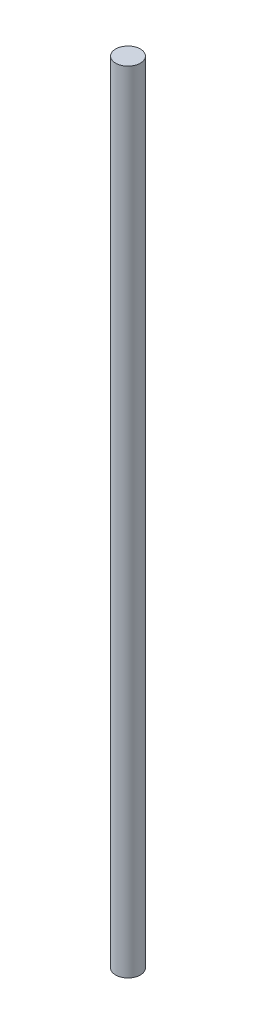
ISO-10303-21;
HEADER;
FILE_DESCRIPTION(('STEP AP214'),'2;1');
FILE_NAME('part.step','',(''),(''),'','','');
FILE_SCHEMA(('AUTOMOTIVE_DESIGN { 1 0 10303 214 1 1 1 1 }'));
ENDSEC;
DATA;
#1=APPLICATION_CONTEXT('core data for automotive mechanical design processes');
#2=APPLICATION_PROTOCOL_DEFINITION('international standard','automotive_design',2000,#1);
#3=PRODUCT_CONTEXT('',#1,'mechanical');
#4=PRODUCT('Part','Part','',(#3));
#5=PRODUCT_RELATED_PRODUCT_CATEGORY('part','',(#4));
#6=PRODUCT_DEFINITION_FORMATION('','',#4);
#7=PRODUCT_DEFINITION_CONTEXT('part definition',#1,'design');
#8=PRODUCT_DEFINITION('design','',#6,#7);
#9=PRODUCT_DEFINITION_SHAPE('','',#8);
#10=(LENGTH_UNIT() NAMED_UNIT(*) SI_UNIT(.MILLI.,.METRE.));
#11=(NAMED_UNIT(*) PLANE_ANGLE_UNIT() SI_UNIT($,.RADIAN.));
#12=(NAMED_UNIT(*) SI_UNIT($,.STERADIAN.) SOLID_ANGLE_UNIT());
#13=UNCERTAINTY_MEASURE_WITH_UNIT(LENGTH_MEASURE(1.E-05),#10,'distance_accuracy_value','');
#14=(GEOMETRIC_REPRESENTATION_CONTEXT(3) GLOBAL_UNCERTAINTY_ASSIGNED_CONTEXT((#13)) GLOBAL_UNIT_ASSIGNED_CONTEXT((#10,
#11,#12)) REPRESENTATION_CONTEXT('',''));
#15=CARTESIAN_POINT('',(0.,0.,0.));
#16=DIRECTION('',(0.,0.,1.));
#17=DIRECTION('',(1.,0.,0.));
#18=AXIS2_PLACEMENT_3D('',#15,#16,#17);
#19=CARTESIAN_POINT('',(0.,101.6,0.));
#20=DIRECTION('',(0.,-1.,0.));
#21=DIRECTION('',(0.,0.,-1.));
#22=AXIS2_PLACEMENT_3D('',#19,#20,#21);
#23=CYLINDRICAL_SURFACE('',#22,1.5875);
#24=CARTESIAN_POINT('',(0.,101.6,0.));
#25=DIRECTION('',(0.,1.,0.));
#26=DIRECTION('',(0.,0.,1.));
#27=AXIS2_PLACEMENT_3D('',#24,#25,#26);
#28=CIRCLE('',#27,1.5875);
#29=CARTESIAN_POINT('',(0.,101.6,1.5875));
#30=VERTEX_POINT('',#29);
#31=EDGE_CURVE('E10',#30,#30,#28,.T.);
#32=ORIENTED_EDGE('',*,*,#31,.F.);
#33=EDGE_LOOP('',(#32));
#34=FACE_BOUND('',#33,.T.);
#35=CARTESIAN_POINT('',(0.,0.,0.));
#36=DIRECTION('',(0.,1.,0.));
#37=DIRECTION('',(0.,0.,1.));
#38=AXIS2_PLACEMENT_3D('',#35,#36,#37);
#39=CIRCLE('',#38,1.5875);
#40=CARTESIAN_POINT('',(0.,0.,1.5875));
#41=VERTEX_POINT('',#40);
#42=EDGE_CURVE('E34',#41,#41,#39,.T.);
#43=ORIENTED_EDGE('',*,*,#42,.T.);
#44=EDGE_LOOP('',(#43));
#45=FACE_BOUND('',#44,.T.);
#46=ADVANCED_FACE('F31',(#34,#45),#23,.T.);
#47=CARTESIAN_POINT('',(0.,101.6,0.));
#48=DIRECTION('',(0.,1.,0.));
#49=DIRECTION('',(0.,0.,1.));
#50=AXIS2_PLACEMENT_3D('',#47,#48,#49);
#51=PLANE('',#50);
#52=ORIENTED_EDGE('',*,*,#31,.T.);
#53=EDGE_LOOP('',(#52));
#54=FACE_BOUND('',#53,.T.);
#55=ADVANCED_FACE('F46',(#54),#51,.T.);
#56=CARTESIAN_POINT('',(0.,0.,0.));
#57=DIRECTION('',(0.,1.,0.));
#58=DIRECTION('',(0.,0.,1.));
#59=AXIS2_PLACEMENT_3D('',#56,#57,#58);
#60=PLANE('',#59);
#61=ORIENTED_EDGE('',*,*,#42,.F.);
#62=EDGE_LOOP('',(#61));
#63=FACE_BOUND('',#62,.T.);
#64=ADVANCED_FACE('F44',(#63),#60,.F.);
#65=CLOSED_SHELL('',(#46,#55,#64));
#66=MANIFOLD_SOLID_BREP('B2',#65);
#67=ADVANCED_BREP_SHAPE_REPRESENTATION('',(#18,#66),#14);
#68=SHAPE_DEFINITION_REPRESENTATION(#9,#67);
ENDSEC;
END-ISO-10303-21;
